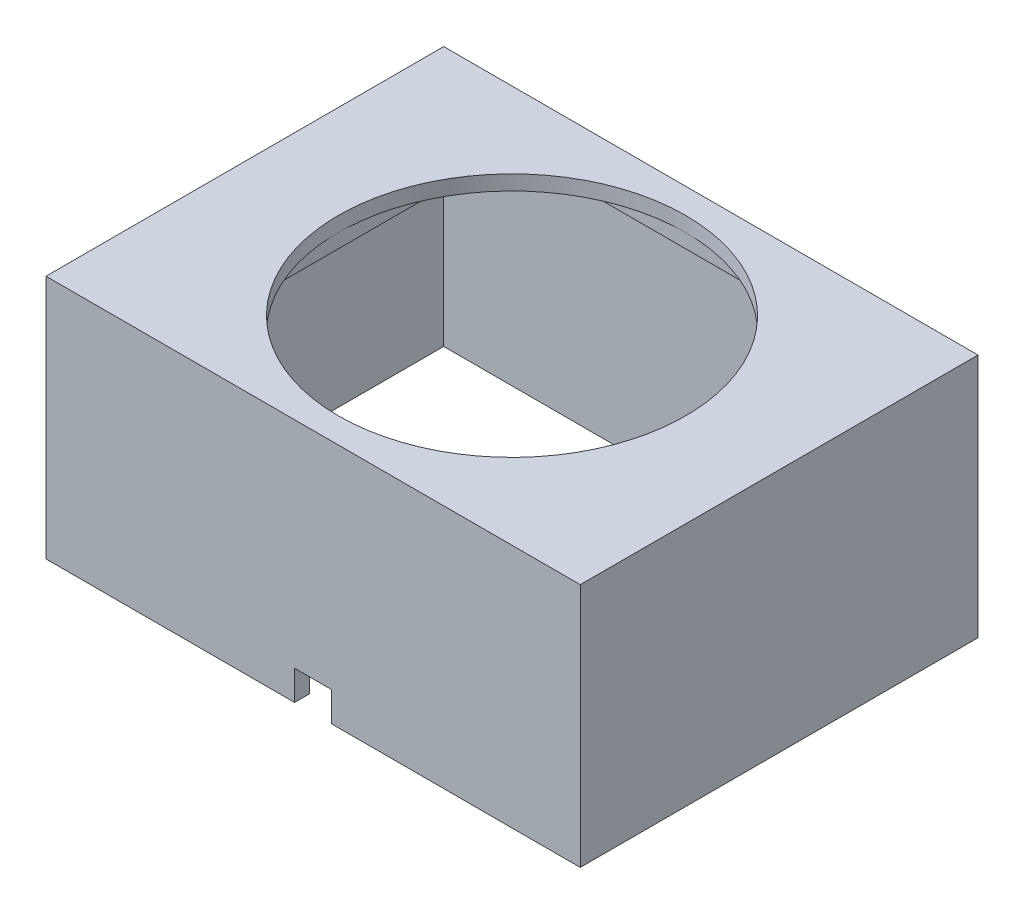
ISO-10303-21;
HEADER;
FILE_DESCRIPTION(('STEP AP214'),'2;1');
FILE_NAME('part.step','',(''),(''),'','','');
FILE_SCHEMA(('AUTOMOTIVE_DESIGN { 1 0 10303 214 1 1 1 1 }'));
ENDSEC;
DATA;
#1=APPLICATION_CONTEXT('core data for automotive mechanical design processes');
#2=APPLICATION_PROTOCOL_DEFINITION('international standard','automotive_design',2000,#1);
#3=PRODUCT_CONTEXT('',#1,'mechanical');
#4=PRODUCT('Part','Part','',(#3));
#5=PRODUCT_RELATED_PRODUCT_CATEGORY('part','',(#4));
#6=PRODUCT_DEFINITION_FORMATION('','',#4);
#7=PRODUCT_DEFINITION_CONTEXT('part definition',#1,'design');
#8=PRODUCT_DEFINITION('design','',#6,#7);
#9=PRODUCT_DEFINITION_SHAPE('','',#8);
#10=(LENGTH_UNIT() NAMED_UNIT(*) SI_UNIT(.MILLI.,.METRE.));
#11=(NAMED_UNIT(*) PLANE_ANGLE_UNIT() SI_UNIT($,.RADIAN.));
#12=(NAMED_UNIT(*) SI_UNIT($,.STERADIAN.) SOLID_ANGLE_UNIT());
#13=UNCERTAINTY_MEASURE_WITH_UNIT(LENGTH_MEASURE(1.E-05),#10,'distance_accuracy_value','');
#14=(GEOMETRIC_REPRESENTATION_CONTEXT(3) GLOBAL_UNCERTAINTY_ASSIGNED_CONTEXT((#13)) GLOBAL_UNIT_ASSIGNED_CONTEXT((#10,
#11,#12)) REPRESENTATION_CONTEXT('',''));
#15=CARTESIAN_POINT('',(0.,0.,0.));
#16=DIRECTION('',(0.,0.,1.));
#17=DIRECTION('',(1.,0.,0.));
#18=AXIS2_PLACEMENT_3D('',#15,#16,#17);
#19=CARTESIAN_POINT('',(0.,14.5,0.));
#20=DIRECTION('',(0.,-1.,0.));
#21=DIRECTION('',(0.,0.,-1.));
#22=AXIS2_PLACEMENT_3D('',#19,#20,#21);
#23=PLANE('',#22);
#24=DIRECTION('',(0.,0.,1.));
#25=VECTOR('',#24,1.);
#26=CARTESIAN_POINT('',(17.,14.5,12.4));
#27=LINE('',#26,#25);
#28=CARTESIAN_POINT('',(17.,14.5,-12.4));
#29=VERTEX_POINT('',#28);
#30=CARTESIAN_POINT('',(17.,14.5,12.4));
#31=VERTEX_POINT('',#30);
#32=EDGE_CURVE('E236',#29,#31,#27,.T.);
#33=ORIENTED_EDGE('',*,*,#32,.T.);
#34=DIRECTION('',(-1.,0.,0.));
#35=VECTOR('',#34,1.);
#36=CARTESIAN_POINT('',(-17.,14.5,12.4));
#37=LINE('',#36,#35);
#38=CARTESIAN_POINT('',(-17.,14.5,12.4));
#39=VERTEX_POINT('',#38);
#40=EDGE_CURVE('E240',#31,#39,#37,.T.);
#41=ORIENTED_EDGE('',*,*,#40,.T.);
#42=DIRECTION('',(0.,0.,-1.));
#43=VECTOR('',#42,1.);
#44=CARTESIAN_POINT('',(-17.,14.5,12.4));
#45=LINE('',#44,#43);
#46=CARTESIAN_POINT('',(-17.,14.5,-12.4));
#47=VERTEX_POINT('',#46);
#48=EDGE_CURVE('E245',#39,#47,#45,.T.);
#49=ORIENTED_EDGE('',*,*,#48,.T.);
#50=DIRECTION('',(1.,0.,0.));
#51=VECTOR('',#50,1.);
#52=CARTESIAN_POINT('',(-17.,14.5,-12.4));
#53=LINE('',#52,#51);
#54=EDGE_CURVE('E249',#47,#29,#53,.T.);
#55=ORIENTED_EDGE('',*,*,#54,.T.);
#56=EDGE_LOOP('',(#33,#41,#49,#55));
#57=FACE_BOUND('',#56,.T.);
#58=DIRECTION('',(0.,0.,-1.));
#59=VECTOR('',#58,1.);
#60=CARTESIAN_POINT('',(-11.75,14.5,11.75));
#61=LINE('',#60,#59);
#62=CARTESIAN_POINT('',(-11.75,14.5,11.75));
#63=VERTEX_POINT('',#62);
#64=CARTESIAN_POINT('',(-11.75,14.5,-11.75));
#65=VERTEX_POINT('',#64);
#66=EDGE_CURVE('E198',#63,#65,#61,.T.);
#67=ORIENTED_EDGE('',*,*,#66,.F.);
#68=DIRECTION('',(1.,0.,0.));
#69=VECTOR('',#68,1.);
#70=CARTESIAN_POINT('',(-11.75,14.5,11.75));
#71=LINE('',#70,#69);
#72=CARTESIAN_POINT('',(11.75,14.5,11.75));
#73=VERTEX_POINT('',#72);
#74=EDGE_CURVE('E210',#63,#73,#71,.T.);
#75=ORIENTED_EDGE('',*,*,#74,.T.);
#76=DIRECTION('',(0.,0.,-1.));
#77=VECTOR('',#76,1.);
#78=CARTESIAN_POINT('',(11.75,14.5,11.75));
#79=LINE('',#78,#77);
#80=CARTESIAN_POINT('',(11.75,14.5,-11.75));
#81=VERTEX_POINT('',#80);
#82=EDGE_CURVE('E214',#73,#81,#79,.T.);
#83=ORIENTED_EDGE('',*,*,#82,.T.);
#84=DIRECTION('',(1.,0.,0.));
#85=VECTOR('',#84,1.);
#86=CARTESIAN_POINT('',(-11.75,14.5,-11.75));
#87=LINE('',#86,#85);
#88=EDGE_CURVE('E64',#65,#81,#87,.T.);
#89=ORIENTED_EDGE('',*,*,#88,.F.);
#90=EDGE_LOOP('',(#67,#75,#83,#89));
#91=FACE_BOUND('',#90,.T.);
#92=ADVANCED_FACE('F39',(#57,#91),#23,.T.);
#93=CARTESIAN_POINT('',(-18.,16.5,-13.4));
#94=DIRECTION('',(1.,0.,0.));
#95=DIRECTION('',(0.,0.,-1.));
#96=AXIS2_PLACEMENT_3D('',#93,#94,#95);
#97=PLANE('',#96);
#98=DIRECTION('',(0.,0.,1.));
#99=VECTOR('',#98,1.);
#100=CARTESIAN_POINT('',(-18.,0.,-13.4));
#101=LINE('',#100,#99);
#102=CARTESIAN_POINT('',(-18.,0.,-13.4));
#103=VERTEX_POINT('',#102);
#104=CARTESIAN_POINT('',(-18.,0.,13.4));
#105=VERTEX_POINT('',#104);
#106=EDGE_CURVE('E269',#103,#105,#101,.T.);
#107=ORIENTED_EDGE('',*,*,#106,.T.);
#108=DIRECTION('',(0.,-1.,0.));
#109=VECTOR('',#108,1.);
#110=CARTESIAN_POINT('',(-18.,16.5,13.4));
#111=LINE('',#110,#109);
#112=CARTESIAN_POINT('',(-18.,16.5,13.4));
#113=VERTEX_POINT('',#112);
#114=EDGE_CURVE('E11',#113,#105,#111,.T.);
#115=ORIENTED_EDGE('',*,*,#114,.F.);
#116=DIRECTION('',(0.,0.,1.));
#117=VECTOR('',#116,1.);
#118=CARTESIAN_POINT('',(-18.,16.5,-13.4));
#119=LINE('',#118,#117);
#120=CARTESIAN_POINT('',(-18.,16.5,-13.4));
#121=VERTEX_POINT('',#120);
#122=EDGE_CURVE('E279',#121,#113,#119,.T.);
#123=ORIENTED_EDGE('',*,*,#122,.F.);
#124=DIRECTION('',(0.,-1.,0.));
#125=VECTOR('',#124,1.);
#126=CARTESIAN_POINT('',(-18.,16.5,-13.4));
#127=LINE('',#126,#125);
#128=EDGE_CURVE('E295',#121,#103,#127,.T.);
#129=ORIENTED_EDGE('',*,*,#128,.T.);
#130=EDGE_LOOP('',(#107,#115,#123,#129));
#131=FACE_BOUND('',#130,.T.);
#132=ADVANCED_FACE('F41',(#131),#97,.F.);
#133=CARTESIAN_POINT('',(-18.,16.5,13.4));
#134=DIRECTION('',(0.,0.,-1.));
#135=DIRECTION('',(-1.,0.,0.));
#136=AXIS2_PLACEMENT_3D('',#133,#134,#135);
#137=PLANE('',#136);
#138=DIRECTION('',(1.,0.,0.));
#139=VECTOR('',#138,1.);
#140=CARTESIAN_POINT('',(-18.,0.,13.4));
#141=LINE('',#140,#139);
#142=CARTESIAN_POINT('',(-1.25,0.,13.4));
#143=VERTEX_POINT('',#142);
#144=EDGE_CURVE('E300',#105,#143,#141,.T.);
#145=ORIENTED_EDGE('',*,*,#144,.T.);
#146=DIRECTION('',(0.,-1.,0.));
#147=VECTOR('',#146,1.);
#148=CARTESIAN_POINT('',(-1.25,2.,13.4));
#149=LINE('',#148,#147);
#150=CARTESIAN_POINT('',(-1.25,2.,13.4));
#151=VERTEX_POINT('',#150);
#152=EDGE_CURVE('E183',#151,#143,#149,.T.);
#153=ORIENTED_EDGE('',*,*,#152,.F.);
#154=DIRECTION('',(1.,0.,0.));
#155=VECTOR('',#154,1.);
#156=CARTESIAN_POINT('',(-1.25,2.,13.4));
#157=LINE('',#156,#155);
#158=CARTESIAN_POINT('',(1.25,2.,13.4));
#159=VERTEX_POINT('',#158);
#160=EDGE_CURVE('E164',#151,#159,#157,.T.);
#161=ORIENTED_EDGE('',*,*,#160,.T.);
#162=DIRECTION('',(0.,-1.,0.));
#163=VECTOR('',#162,1.);
#164=CARTESIAN_POINT('',(1.25,2.,13.4));
#165=LINE('',#164,#163);
#166=CARTESIAN_POINT('',(1.25,0.,13.4));
#167=VERTEX_POINT('',#166);
#168=EDGE_CURVE('E161',#159,#167,#165,.T.);
#169=ORIENTED_EDGE('',*,*,#168,.T.);
#170=CARTESIAN_POINT('',(18.,0.,13.4));
#171=VERTEX_POINT('',#170);
#172=EDGE_CURVE('E299',#167,#171,#141,.T.);
#173=ORIENTED_EDGE('',*,*,#172,.T.);
#174=DIRECTION('',(0.,-1.,0.));
#175=VECTOR('',#174,1.);
#176=CARTESIAN_POINT('',(18.,16.5,13.4));
#177=LINE('',#176,#175);
#178=CARTESIAN_POINT('',(18.,16.5,13.4));
#179=VERTEX_POINT('',#178);
#180=EDGE_CURVE('E49',#179,#171,#177,.T.);
#181=ORIENTED_EDGE('',*,*,#180,.F.);
#182=DIRECTION('',(1.,0.,0.));
#183=VECTOR('',#182,1.);
#184=CARTESIAN_POINT('',(-18.,16.5,13.4));
#185=LINE('',#184,#183);
#186=EDGE_CURVE('E283',#113,#179,#185,.T.);
#187=ORIENTED_EDGE('',*,*,#186,.F.);
#188=ORIENTED_EDGE('',*,*,#114,.T.);
#189=EDGE_LOOP('',(#145,#153,#161,#169,#173,#181,#187,#188));
#190=FACE_BOUND('',#189,.T.);
#191=ADVANCED_FACE('F337',(#190),#137,.F.);
#192=CARTESIAN_POINT('',(18.,16.5,-13.4));
#193=DIRECTION('',(1.,0.,0.));
#194=DIRECTION('',(0.,0.,-1.));
#195=AXIS2_PLACEMENT_3D('',#192,#193,#194);
#196=PLANE('',#195);
#197=DIRECTION('',(0.,0.,1.));
#198=VECTOR('',#197,1.);
#199=CARTESIAN_POINT('',(18.,0.,-13.4));
#200=LINE('',#199,#198);
#201=CARTESIAN_POINT('',(18.,0.,-13.4));
#202=VERTEX_POINT('',#201);
#203=EDGE_CURVE('E304',#202,#171,#200,.T.);
#204=ORIENTED_EDGE('',*,*,#203,.F.);
#205=DIRECTION('',(0.,-1.,0.));
#206=VECTOR('',#205,1.);
#207=CARTESIAN_POINT('',(18.,16.5,-13.4));
#208=LINE('',#207,#206);
#209=CARTESIAN_POINT('',(18.,16.5,-13.4));
#210=VERTEX_POINT('',#209);
#211=EDGE_CURVE('E313',#210,#202,#208,.T.);
#212=ORIENTED_EDGE('',*,*,#211,.F.);
#213=DIRECTION('',(0.,0.,1.));
#214=VECTOR('',#213,1.);
#215=CARTESIAN_POINT('',(18.,16.5,-13.4));
#216=LINE('',#215,#214);
#217=EDGE_CURVE('E287',#210,#179,#216,.T.);
#218=ORIENTED_EDGE('',*,*,#217,.T.);
#219=ORIENTED_EDGE('',*,*,#180,.T.);
#220=EDGE_LOOP('',(#204,#212,#218,#219));
#221=FACE_BOUND('',#220,.T.);
#222=ADVANCED_FACE('F321',(#221),#196,.T.);
#223=CARTESIAN_POINT('',(-18.,16.5,-13.4));
#224=DIRECTION('',(0.,0.,-1.));
#225=DIRECTION('',(-1.,0.,0.));
#226=AXIS2_PLACEMENT_3D('',#223,#224,#225);
#227=PLANE('',#226);
#228=DIRECTION('',(1.,0.,0.));
#229=VECTOR('',#228,1.);
#230=CARTESIAN_POINT('',(-18.,0.,-13.4));
#231=LINE('',#230,#229);
#232=EDGE_CURVE('E284',#103,#202,#231,.T.);
#233=ORIENTED_EDGE('',*,*,#232,.F.);
#234=ORIENTED_EDGE('',*,*,#128,.F.);
#235=DIRECTION('',(1.,0.,0.));
#236=VECTOR('',#235,1.);
#237=CARTESIAN_POINT('',(-18.,16.5,-13.4));
#238=LINE('',#237,#236);
#239=EDGE_CURVE('E291',#121,#210,#238,.T.);
#240=ORIENTED_EDGE('',*,*,#239,.T.);
#241=ORIENTED_EDGE('',*,*,#211,.T.);
#242=EDGE_LOOP('',(#233,#234,#240,#241));
#243=FACE_BOUND('',#242,.T.);
#244=ADVANCED_FACE('F331',(#243),#227,.T.);
#245=CARTESIAN_POINT('',(0.,16.5,0.));
#246=DIRECTION('',(0.,1.,0.));
#247=DIRECTION('',(0.,0.,1.));
#248=AXIS2_PLACEMENT_3D('',#245,#246,#247);
#249=PLANE('',#248);
#250=CARTESIAN_POINT('',(0.,16.5,0.));
#251=DIRECTION('',(0.,1.,0.));
#252=DIRECTION('',(0.,0.,1.));
#253=AXIS2_PLACEMENT_3D('',#250,#251,#252);
#254=CIRCLE('',#253,11.7);
#255=CARTESIAN_POINT('',(0.,16.5,11.7));
#256=VERTEX_POINT('',#255);
#257=EDGE_CURVE('E43',#256,#256,#254,.T.);
#258=ORIENTED_EDGE('',*,*,#257,.F.);
#259=EDGE_LOOP('',(#258));
#260=FACE_BOUND('',#259,.T.);
#261=ORIENTED_EDGE('',*,*,#122,.T.);
#262=ORIENTED_EDGE('',*,*,#186,.T.);
#263=ORIENTED_EDGE('',*,*,#217,.F.);
#264=ORIENTED_EDGE('',*,*,#239,.F.);
#265=EDGE_LOOP('',(#261,#262,#263,#264));
#266=FACE_BOUND('',#265,.T.);
#267=ADVANCED_FACE('F335',(#260,#266),#249,.T.);
#268=CARTESIAN_POINT('',(0.,0.,0.));
#269=DIRECTION('',(0.,1.,0.));
#270=DIRECTION('',(0.,0.,1.));
#271=AXIS2_PLACEMENT_3D('',#268,#269,#270);
#272=PLANE('',#271);
#273=DIRECTION('',(-1.,0.,0.));
#274=VECTOR('',#273,1.);
#275=CARTESIAN_POINT('',(-17.,0.,12.4));
#276=LINE('',#275,#274);
#277=CARTESIAN_POINT('',(-1.25,0.,12.4));
#278=VERTEX_POINT('',#277);
#279=CARTESIAN_POINT('',(-17.,0.,12.4));
#280=VERTEX_POINT('',#279);
#281=EDGE_CURVE('E256',#278,#280,#276,.T.);
#282=ORIENTED_EDGE('',*,*,#281,.F.);
#283=DIRECTION('',(0.,0.,-1.));
#284=VECTOR('',#283,1.);
#285=CARTESIAN_POINT('',(-1.25,0.,13.4));
#286=LINE('',#285,#284);
#287=EDGE_CURVE('E172',#143,#278,#286,.T.);
#288=ORIENTED_EDGE('',*,*,#287,.F.);
#289=ORIENTED_EDGE('',*,*,#144,.F.);
#290=ORIENTED_EDGE('',*,*,#106,.F.);
#291=ORIENTED_EDGE('',*,*,#232,.T.);
#292=ORIENTED_EDGE('',*,*,#203,.T.);
#293=ORIENTED_EDGE('',*,*,#172,.F.);
#294=DIRECTION('',(0.,0.,-1.));
#295=VECTOR('',#294,1.);
#296=CARTESIAN_POINT('',(1.25,0.,13.4));
#297=LINE('',#296,#295);
#298=CARTESIAN_POINT('',(1.25,0.,12.4));
#299=VERTEX_POINT('',#298);
#300=EDGE_CURVE('E522',#167,#299,#297,.T.);
#301=ORIENTED_EDGE('',*,*,#300,.T.);
#302=CARTESIAN_POINT('',(17.,0.,12.4));
#303=VERTEX_POINT('',#302);
#304=EDGE_CURVE('E178',#303,#299,#276,.T.);
#305=ORIENTED_EDGE('',*,*,#304,.F.);
#306=DIRECTION('',(0.,0.,1.));
#307=VECTOR('',#306,1.);
#308=CARTESIAN_POINT('',(17.,0.,12.4));
#309=LINE('',#308,#307);
#310=CARTESIAN_POINT('',(17.,0.,-12.4));
#311=VERTEX_POINT('',#310);
#312=EDGE_CURVE('E235',#311,#303,#309,.T.);
#313=ORIENTED_EDGE('',*,*,#312,.F.);
#314=DIRECTION('',(1.,0.,0.));
#315=VECTOR('',#314,1.);
#316=CARTESIAN_POINT('',(-17.,0.,-12.4));
#317=LINE('',#316,#315);
#318=CARTESIAN_POINT('',(-17.,0.,-12.4));
#319=VERTEX_POINT('',#318);
#320=EDGE_CURVE('E241',#319,#311,#317,.T.);
#321=ORIENTED_EDGE('',*,*,#320,.F.);
#322=DIRECTION('',(0.,0.,-1.));
#323=VECTOR('',#322,1.);
#324=CARTESIAN_POINT('',(-17.,0.,12.4));
#325=LINE('',#324,#323);
#326=EDGE_CURVE('E259',#280,#319,#325,.T.);
#327=ORIENTED_EDGE('',*,*,#326,.F.);
#328=EDGE_LOOP('',(#282,#288,#289,#290,#291,#292,#293,#301,#305,#313,#321,#327));
#329=FACE_BOUND('',#328,.T.);
#330=ADVANCED_FACE('F327',(#329),#272,.F.);
#331=CARTESIAN_POINT('',(17.,14.5,12.4));
#332=DIRECTION('',(1.,0.,0.));
#333=DIRECTION('',(0.,0.,-1.));
#334=AXIS2_PLACEMENT_3D('',#331,#332,#333);
#335=PLANE('',#334);
#336=ORIENTED_EDGE('',*,*,#312,.T.);
#337=DIRECTION('',(0.,-1.,0.));
#338=VECTOR('',#337,1.);
#339=CARTESIAN_POINT('',(17.,14.5,12.4));
#340=LINE('',#339,#338);
#341=EDGE_CURVE('E253',#31,#303,#340,.T.);
#342=ORIENTED_EDGE('',*,*,#341,.F.);
#343=ORIENTED_EDGE('',*,*,#32,.F.);
#344=DIRECTION('',(0.,-1.,0.));
#345=VECTOR('',#344,1.);
#346=CARTESIAN_POINT('',(17.,14.5,-12.4));
#347=LINE('',#346,#345);
#348=EDGE_CURVE('E266',#29,#311,#347,.T.);
#349=ORIENTED_EDGE('',*,*,#348,.T.);
#350=EDGE_LOOP('',(#336,#342,#343,#349));
#351=FACE_BOUND('',#350,.T.);
#352=ADVANCED_FACE('F358',(#351),#335,.F.);
#353=CARTESIAN_POINT('',(-17.,14.5,-12.4));
#354=DIRECTION('',(0.,0.,-1.));
#355=DIRECTION('',(-1.,0.,0.));
#356=AXIS2_PLACEMENT_3D('',#353,#354,#355);
#357=PLANE('',#356);
#358=ORIENTED_EDGE('',*,*,#320,.T.);
#359=ORIENTED_EDGE('',*,*,#348,.F.);
#360=ORIENTED_EDGE('',*,*,#54,.F.);
#361=DIRECTION('',(0.,-1.,0.));
#362=VECTOR('',#361,1.);
#363=CARTESIAN_POINT('',(-17.,14.5,-12.4));
#364=LINE('',#363,#362);
#365=EDGE_CURVE('E270',#47,#319,#364,.T.);
#366=ORIENTED_EDGE('',*,*,#365,.T.);
#367=EDGE_LOOP('',(#358,#359,#360,#366));
#368=FACE_BOUND('',#367,.T.);
#369=ADVANCED_FACE('F354',(#368),#357,.F.);
#370=CARTESIAN_POINT('',(-17.,14.5,12.4));
#371=DIRECTION('',(-1.,0.,0.));
#372=DIRECTION('',(0.,0.,1.));
#373=AXIS2_PLACEMENT_3D('',#370,#371,#372);
#374=PLANE('',#373);
#375=ORIENTED_EDGE('',*,*,#326,.T.);
#376=ORIENTED_EDGE('',*,*,#365,.F.);
#377=ORIENTED_EDGE('',*,*,#48,.F.);
#378=DIRECTION('',(0.,-1.,0.));
#379=VECTOR('',#378,1.);
#380=CARTESIAN_POINT('',(-17.,14.5,12.4));
#381=LINE('',#380,#379);
#382=EDGE_CURVE('E273',#39,#280,#381,.T.);
#383=ORIENTED_EDGE('',*,*,#382,.T.);
#384=EDGE_LOOP('',(#375,#376,#377,#383));
#385=FACE_BOUND('',#384,.T.);
#386=ADVANCED_FACE('F357',(#385),#374,.F.);
#387=CARTESIAN_POINT('',(-17.,14.5,12.4));
#388=DIRECTION('',(0.,0.,1.));
#389=DIRECTION('',(1.,0.,0.));
#390=AXIS2_PLACEMENT_3D('',#387,#388,#389);
#391=PLANE('',#390);
#392=DIRECTION('',(1.,0.,0.));
#393=VECTOR('',#392,1.);
#394=CARTESIAN_POINT('',(-1.25,2.,12.4));
#395=LINE('',#394,#393);
#396=CARTESIAN_POINT('',(-1.25,2.,12.4));
#397=VERTEX_POINT('',#396);
#398=CARTESIAN_POINT('',(1.25,2.,12.4));
#399=VERTEX_POINT('',#398);
#400=EDGE_CURVE('E165',#397,#399,#395,.T.);
#401=ORIENTED_EDGE('',*,*,#400,.F.);
#402=DIRECTION('',(0.,-1.,0.));
#403=VECTOR('',#402,1.);
#404=CARTESIAN_POINT('',(-1.25,2.,12.4));
#405=LINE('',#404,#403);
#406=EDGE_CURVE('E192',#397,#278,#405,.T.);
#407=ORIENTED_EDGE('',*,*,#406,.T.);
#408=ORIENTED_EDGE('',*,*,#281,.T.);
#409=ORIENTED_EDGE('',*,*,#382,.F.);
#410=ORIENTED_EDGE('',*,*,#40,.F.);
#411=ORIENTED_EDGE('',*,*,#341,.T.);
#412=ORIENTED_EDGE('',*,*,#304,.T.);
#413=DIRECTION('',(0.,-1.,0.));
#414=VECTOR('',#413,1.);
#415=CARTESIAN_POINT('',(1.25,2.,12.4));
#416=LINE('',#415,#414);
#417=EDGE_CURVE('E158',#399,#299,#416,.T.);
#418=ORIENTED_EDGE('',*,*,#417,.F.);
#419=EDGE_LOOP('',(#401,#407,#408,#409,#410,#411,#412,#418));
#420=FACE_BOUND('',#419,.T.);
#421=ADVANCED_FACE('F175',(#420),#391,.F.);
#422=CARTESIAN_POINT('',(-11.75,15.5,11.75));
#423=DIRECTION('',(0.,0.,-1.));
#424=DIRECTION('',(-1.,0.,0.));
#425=AXIS2_PLACEMENT_3D('',#422,#423,#424);
#426=PLANE('',#425);
#427=ORIENTED_EDGE('',*,*,#74,.F.);
#428=DIRECTION('',(0.,-1.,0.));
#429=VECTOR('',#428,1.);
#430=CARTESIAN_POINT('',(-11.75,15.5,11.75));
#431=LINE('',#430,#429);
#432=CARTESIAN_POINT('',(-11.75,15.5,11.75));
#433=VERTEX_POINT('',#432);
#434=EDGE_CURVE('E209',#433,#63,#431,.T.);
#435=ORIENTED_EDGE('',*,*,#434,.F.);
#436=DIRECTION('',(1.,0.,0.));
#437=VECTOR('',#436,1.);
#438=CARTESIAN_POINT('',(-11.75,15.5,11.75));
#439=LINE('',#438,#437);
#440=CARTESIAN_POINT('',(11.75,15.5,11.75));
#441=VERTEX_POINT('',#440);
#442=EDGE_CURVE('E193',#433,#441,#439,.T.);
#443=ORIENTED_EDGE('',*,*,#442,.T.);
#444=DIRECTION('',(0.,-1.,0.));
#445=VECTOR('',#444,1.);
#446=CARTESIAN_POINT('',(11.75,15.5,11.75));
#447=LINE('',#446,#445);
#448=EDGE_CURVE('E231',#441,#73,#447,.T.);
#449=ORIENTED_EDGE('',*,*,#448,.T.);
#450=EDGE_LOOP('',(#427,#435,#443,#449));
#451=FACE_BOUND('',#450,.T.);
#452=ADVANCED_FACE('F352',(#451),#426,.T.);
#453=CARTESIAN_POINT('',(11.75,15.5,11.75));
#454=DIRECTION('',(-1.,0.,0.));
#455=DIRECTION('',(0.,0.,1.));
#456=AXIS2_PLACEMENT_3D('',#453,#454,#455);
#457=PLANE('',#456);
#458=ORIENTED_EDGE('',*,*,#82,.F.);
#459=ORIENTED_EDGE('',*,*,#448,.F.);
#460=DIRECTION('',(0.,0.,-1.));
#461=VECTOR('',#460,1.);
#462=CARTESIAN_POINT('',(11.75,15.5,11.75));
#463=LINE('',#462,#461);
#464=CARTESIAN_POINT('',(11.75,15.5,-11.75));
#465=VERTEX_POINT('',#464);
#466=EDGE_CURVE('E197',#441,#465,#463,.T.);
#467=ORIENTED_EDGE('',*,*,#466,.T.);
#468=DIRECTION('',(0.,-1.,0.));
#469=VECTOR('',#468,1.);
#470=CARTESIAN_POINT('',(11.75,15.5,-11.75));
#471=LINE('',#470,#469);
#472=EDGE_CURVE('E228',#465,#81,#471,.T.);
#473=ORIENTED_EDGE('',*,*,#472,.T.);
#474=EDGE_LOOP('',(#458,#459,#467,#473));
#475=FACE_BOUND('',#474,.T.);
#476=ADVANCED_FACE('F417',(#475),#457,.T.);
#477=CARTESIAN_POINT('',(-11.75,15.5,-11.75));
#478=DIRECTION('',(0.,0.,-1.));
#479=DIRECTION('',(-1.,0.,0.));
#480=AXIS2_PLACEMENT_3D('',#477,#478,#479);
#481=PLANE('',#480);
#482=ORIENTED_EDGE('',*,*,#88,.T.);
#483=ORIENTED_EDGE('',*,*,#472,.F.);
#484=DIRECTION('',(1.,0.,0.));
#485=VECTOR('',#484,1.);
#486=CARTESIAN_POINT('',(-11.75,15.5,-11.75));
#487=LINE('',#486,#485);
#488=CARTESIAN_POINT('',(-11.75,15.5,-11.75));
#489=VERTEX_POINT('',#488);
#490=EDGE_CURVE('E201',#489,#465,#487,.T.);
#491=ORIENTED_EDGE('',*,*,#490,.F.);
#492=DIRECTION('',(0.,-1.,0.));
#493=VECTOR('',#492,1.);
#494=CARTESIAN_POINT('',(-11.75,15.5,-11.75));
#495=LINE('',#494,#493);
#496=EDGE_CURVE('E225',#489,#65,#495,.T.);
#497=ORIENTED_EDGE('',*,*,#496,.T.);
#498=EDGE_LOOP('',(#482,#483,#491,#497));
#499=FACE_BOUND('',#498,.T.);
#500=ADVANCED_FACE('F424',(#499),#481,.F.);
#501=CARTESIAN_POINT('',(-11.75,15.5,11.75));
#502=DIRECTION('',(-1.,0.,0.));
#503=DIRECTION('',(0.,0.,1.));
#504=AXIS2_PLACEMENT_3D('',#501,#502,#503);
#505=PLANE('',#504);
#506=ORIENTED_EDGE('',*,*,#66,.T.);
#507=ORIENTED_EDGE('',*,*,#496,.F.);
#508=DIRECTION('',(0.,0.,-1.));
#509=VECTOR('',#508,1.);
#510=CARTESIAN_POINT('',(-11.75,15.5,11.75));
#511=LINE('',#510,#509);
#512=EDGE_CURVE('E205',#433,#489,#511,.T.);
#513=ORIENTED_EDGE('',*,*,#512,.F.);
#514=ORIENTED_EDGE('',*,*,#434,.T.);
#515=EDGE_LOOP('',(#506,#507,#513,#514));
#516=FACE_BOUND('',#515,.T.);
#517=ADVANCED_FACE('F431',(#516),#505,.F.);
#518=CARTESIAN_POINT('',(0.,15.5,0.));
#519=DIRECTION('',(0.,1.,0.));
#520=DIRECTION('',(0.,0.,1.));
#521=AXIS2_PLACEMENT_3D('',#518,#519,#520);
#522=PLANE('',#521);
#523=CARTESIAN_POINT('',(0.,15.5,0.));
#524=DIRECTION('',(0.,-1.,0.));
#525=DIRECTION('',(0.,0.,-1.));
#526=AXIS2_PLACEMENT_3D('',#523,#524,#525);
#527=CIRCLE('',#526,11.7);
#528=CARTESIAN_POINT('',(0.,15.5,-11.7));
#529=VERTEX_POINT('',#528);
#530=EDGE_CURVE('E188',#529,#529,#527,.T.);
#531=ORIENTED_EDGE('',*,*,#530,.F.);
#532=EDGE_LOOP('',(#531));
#533=FACE_BOUND('',#532,.T.);
#534=ORIENTED_EDGE('',*,*,#442,.F.);
#535=ORIENTED_EDGE('',*,*,#512,.T.);
#536=ORIENTED_EDGE('',*,*,#490,.T.);
#537=ORIENTED_EDGE('',*,*,#466,.F.);
#538=EDGE_LOOP('',(#534,#535,#536,#537));
#539=FACE_BOUND('',#538,.T.);
#540=ADVANCED_FACE('F437',(#533,#539),#522,.F.);
#541=CARTESIAN_POINT('',(0.,21.5,0.));
#542=DIRECTION('',(0.,-1.,0.));
#543=DIRECTION('',(0.,0.,-1.));
#544=AXIS2_PLACEMENT_3D('',#541,#542,#543);
#545=CYLINDRICAL_SURFACE('',#544,11.7);
#546=ORIENTED_EDGE('',*,*,#257,.T.);
#547=EDGE_LOOP('',(#546));
#548=FACE_BOUND('',#547,.T.);
#549=ORIENTED_EDGE('',*,*,#530,.T.);
#550=EDGE_LOOP('',(#549));
#551=FACE_BOUND('',#550,.T.);
#552=ADVANCED_FACE('F444',(#548,#551),#545,.F.);
#553=CARTESIAN_POINT('',(-1.25,2.,13.4));
#554=DIRECTION('',(-1.,0.,0.));
#555=DIRECTION('',(0.,0.,1.));
#556=AXIS2_PLACEMENT_3D('',#553,#554,#555);
#557=PLANE('',#556);
#558=ORIENTED_EDGE('',*,*,#287,.T.);
#559=ORIENTED_EDGE('',*,*,#406,.F.);
#560=DIRECTION('',(0.,0.,-1.));
#561=VECTOR('',#560,1.);
#562=CARTESIAN_POINT('',(-1.25,2.,13.4));
#563=LINE('',#562,#561);
#564=EDGE_CURVE('E56',#151,#397,#563,.T.);
#565=ORIENTED_EDGE('',*,*,#564,.F.);
#566=ORIENTED_EDGE('',*,*,#152,.T.);
#567=EDGE_LOOP('',(#558,#559,#565,#566));
#568=FACE_BOUND('',#567,.T.);
#569=ADVANCED_FACE('F452',(#568),#557,.F.);
#570=CARTESIAN_POINT('',(1.25,2.,13.4));
#571=DIRECTION('',(-1.,0.,0.));
#572=DIRECTION('',(0.,0.,1.));
#573=AXIS2_PLACEMENT_3D('',#570,#571,#572);
#574=PLANE('',#573);
#575=ORIENTED_EDGE('',*,*,#300,.F.);
#576=ORIENTED_EDGE('',*,*,#168,.F.);
#577=DIRECTION('',(0.,0.,-1.));
#578=VECTOR('',#577,1.);
#579=CARTESIAN_POINT('',(1.25,2.,13.4));
#580=LINE('',#579,#578);
#581=EDGE_CURVE('E155',#159,#399,#580,.T.);
#582=ORIENTED_EDGE('',*,*,#581,.T.);
#583=ORIENTED_EDGE('',*,*,#417,.T.);
#584=EDGE_LOOP('',(#575,#576,#582,#583));
#585=FACE_BOUND('',#584,.T.);
#586=ADVANCED_FACE('F156',(#585),#574,.T.);
#587=CARTESIAN_POINT('',(0.,2.,0.));
#588=DIRECTION('',(0.,1.,0.));
#589=DIRECTION('',(0.,0.,1.));
#590=AXIS2_PLACEMENT_3D('',#587,#588,#589);
#591=PLANE('',#590);
#592=ORIENTED_EDGE('',*,*,#400,.T.);
#593=ORIENTED_EDGE('',*,*,#581,.F.);
#594=ORIENTED_EDGE('',*,*,#160,.F.);
#595=ORIENTED_EDGE('',*,*,#564,.T.);
#596=EDGE_LOOP('',(#592,#593,#594,#595));
#597=FACE_BOUND('',#596,.T.);
#598=ADVANCED_FACE('F168',(#597),#591,.F.);
#599=CLOSED_SHELL('',(#92,#132,#191,#222,#244,#267,#330,#352,#369,#386,#421,#452,#476,#500,#517,
#540,#552,#569,#586,#598));
#600=MANIFOLD_SOLID_BREP('B2',#599);
#601=ADVANCED_BREP_SHAPE_REPRESENTATION('',(#18,#600),#14);
#602=SHAPE_DEFINITION_REPRESENTATION(#9,#601);
ENDSEC;
END-ISO-10303-21;
